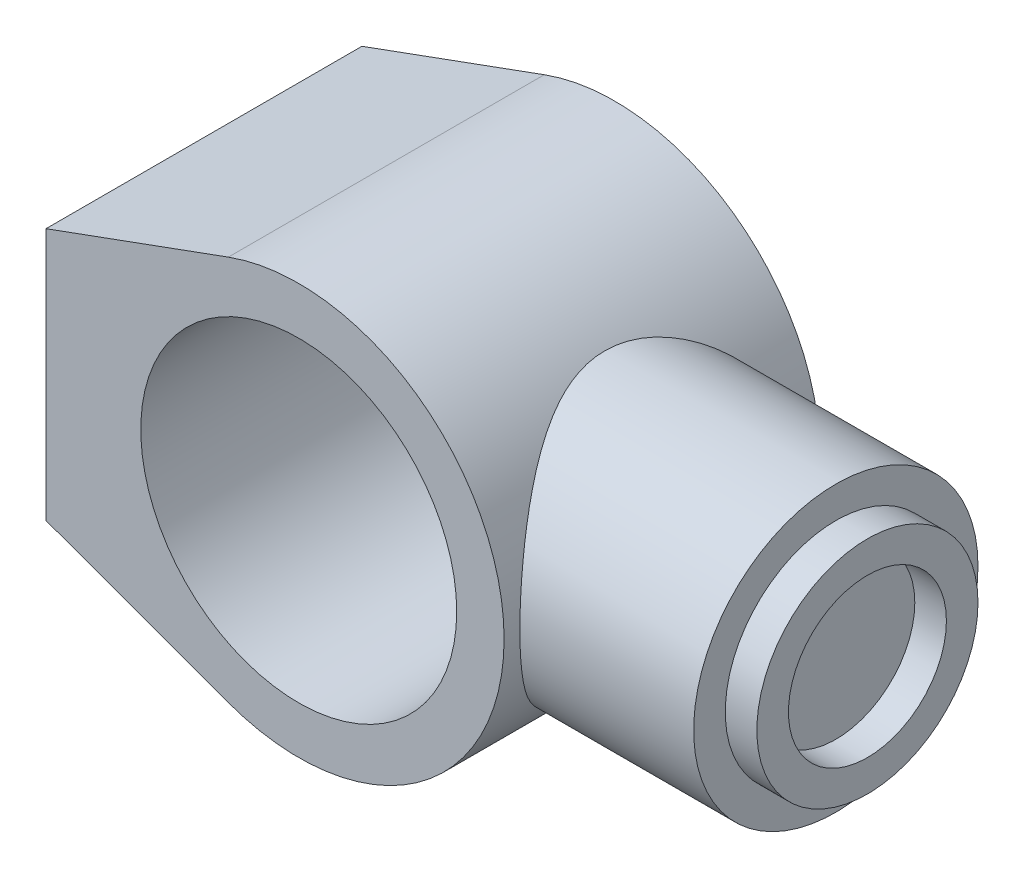
ISO-10303-21;
HEADER;
FILE_DESCRIPTION(('STEP AP214'),'2;1');
FILE_NAME('part.step','',(''),(''),'','','');
FILE_SCHEMA(('AUTOMOTIVE_DESIGN { 1 0 10303 214 1 1 1 1 }'));
ENDSEC;
DATA;
#1=APPLICATION_CONTEXT('core data for automotive mechanical design processes');
#2=APPLICATION_PROTOCOL_DEFINITION('international standard','automotive_design',2000,#1);
#3=PRODUCT_CONTEXT('',#1,'mechanical');
#4=PRODUCT('Part','Part','',(#3));
#5=PRODUCT_RELATED_PRODUCT_CATEGORY('part','',(#4));
#6=PRODUCT_DEFINITION_FORMATION('','',#4);
#7=PRODUCT_DEFINITION_CONTEXT('part definition',#1,'design');
#8=PRODUCT_DEFINITION('design','',#6,#7);
#9=PRODUCT_DEFINITION_SHAPE('','',#8);
#10=(LENGTH_UNIT() NAMED_UNIT(*) SI_UNIT(.MILLI.,.METRE.));
#11=(NAMED_UNIT(*) PLANE_ANGLE_UNIT() SI_UNIT($,.RADIAN.));
#12=(NAMED_UNIT(*) SI_UNIT($,.STERADIAN.) SOLID_ANGLE_UNIT());
#13=UNCERTAINTY_MEASURE_WITH_UNIT(LENGTH_MEASURE(1.E-05),#10,'distance_accuracy_value','');
#14=(GEOMETRIC_REPRESENTATION_CONTEXT(3) GLOBAL_UNCERTAINTY_ASSIGNED_CONTEXT((#13)) GLOBAL_UNIT_ASSIGNED_CONTEXT((#10,
#11,#12)) REPRESENTATION_CONTEXT('',''));
#15=CARTESIAN_POINT('',(0.,0.,0.));
#16=DIRECTION('',(0.,0.,1.));
#17=DIRECTION('',(1.,0.,0.));
#18=AXIS2_PLACEMENT_3D('',#15,#16,#17);
#19=CARTESIAN_POINT('',(0.,0.,50.));
#20=DIRECTION('',(0.,0.,1.));
#21=DIRECTION('',(1.,0.,0.));
#22=AXIS2_PLACEMENT_3D('',#19,#20,#21);
#23=PLANE('',#22);
#24=CARTESIAN_POINT('',(0.,0.,50.));
#25=DIRECTION('',(0.,0.,1.));
#26=DIRECTION('',(1.,0.,0.));
#27=AXIS2_PLACEMENT_3D('',#24,#25,#26);
#28=CIRCLE('',#27,65.);
#29=CARTESIAN_POINT('',(-22.2816656929027,-61.0616686141946,50.));
#30=VERTEX_POINT('',#29);
#31=CARTESIAN_POINT('',(-22.2816656929027,61.0616686141946,50.));
#32=VERTEX_POINT('',#31);
#33=EDGE_CURVE('E93',#30,#32,#28,.T.);
#34=ORIENTED_EDGE('',*,*,#33,.T.);
#35=DIRECTION('',(-0.939410286372225,-0.342794856813887,0.));
#36=VECTOR('',#35,1.);
#37=CARTESIAN_POINT('',(-80.,40.,50.));
#38=LINE('',#37,#36);
#39=CARTESIAN_POINT('',(-80.,40.,50.));
#40=VERTEX_POINT('',#39);
#41=EDGE_CURVE('E88',#32,#40,#38,.T.);
#42=ORIENTED_EDGE('',*,*,#41,.T.);
#43=DIRECTION('',(0.,-1.,0.));
#44=VECTOR('',#43,1.);
#45=CARTESIAN_POINT('',(-80.,40.,50.));
#46=LINE('',#45,#44);
#47=CARTESIAN_POINT('',(-80.,-40.,50.));
#48=VERTEX_POINT('',#47);
#49=EDGE_CURVE('E91',#40,#48,#46,.T.);
#50=ORIENTED_EDGE('',*,*,#49,.T.);
#51=DIRECTION('',(0.939410286372225,-0.342794856813887,0.));
#52=VECTOR('',#51,1.);
#53=CARTESIAN_POINT('',(-80.,-40.,50.));
#54=LINE('',#53,#52);
#55=EDGE_CURVE('E57',#48,#30,#54,.T.);
#56=ORIENTED_EDGE('',*,*,#55,.T.);
#57=EDGE_LOOP('',(#34,#42,#50,#56));
#58=FACE_BOUND('',#57,.T.);
#59=CARTESIAN_POINT('',(0.,0.,50.));
#60=DIRECTION('',(0.,0.,1.));
#61=DIRECTION('',(1.,0.,0.));
#62=AXIS2_PLACEMENT_3D('',#59,#60,#61);
#63=CIRCLE('',#62,50.);
#64=CARTESIAN_POINT('',(50.,0.,50.));
#65=VERTEX_POINT('',#64);
#66=EDGE_CURVE('E115',#65,#65,#63,.T.);
#67=ORIENTED_EDGE('',*,*,#66,.F.);
#68=EDGE_LOOP('',(#67));
#69=FACE_BOUND('',#68,.T.);
#70=ADVANCED_FACE('F39',(#58,#69),#23,.T.);
#71=CARTESIAN_POINT('',(0.,0.,-50.));
#72=DIRECTION('',(0.,0.,1.));
#73=DIRECTION('',(1.,0.,0.));
#74=AXIS2_PLACEMENT_3D('',#71,#72,#73);
#75=PLANE('',#74);
#76=CARTESIAN_POINT('',(0.,0.,-50.));
#77=DIRECTION('',(0.,0.,1.));
#78=DIRECTION('',(1.,0.,0.));
#79=AXIS2_PLACEMENT_3D('',#76,#77,#78);
#80=CIRCLE('',#79,65.);
#81=CARTESIAN_POINT('',(-22.2816656929027,-61.0616686141946,-50.));
#82=VERTEX_POINT('',#81);
#83=CARTESIAN_POINT('',(-22.2816656929027,61.0616686141946,-50.));
#84=VERTEX_POINT('',#83);
#85=EDGE_CURVE('E111',#82,#84,#80,.T.);
#86=ORIENTED_EDGE('',*,*,#85,.F.);
#87=DIRECTION('',(0.939410286372225,-0.342794856813887,0.));
#88=VECTOR('',#87,1.);
#89=CARTESIAN_POINT('',(-80.,-40.,-50.));
#90=LINE('',#89,#88);
#91=CARTESIAN_POINT('',(-80.,-40.,-50.));
#92=VERTEX_POINT('',#91);
#93=EDGE_CURVE('E80',#92,#82,#90,.T.);
#94=ORIENTED_EDGE('',*,*,#93,.F.);
#95=DIRECTION('',(0.,-1.,0.));
#96=VECTOR('',#95,1.);
#97=CARTESIAN_POINT('',(-80.,40.,-50.));
#98=LINE('',#97,#96);
#99=CARTESIAN_POINT('',(-80.,40.,-50.));
#100=VERTEX_POINT('',#99);
#101=EDGE_CURVE('E74',#100,#92,#98,.T.);
#102=ORIENTED_EDGE('',*,*,#101,.F.);
#103=DIRECTION('',(-0.939410286372225,-0.342794856813887,0.));
#104=VECTOR('',#103,1.);
#105=CARTESIAN_POINT('',(-80.,40.,-50.));
#106=LINE('',#105,#104);
#107=EDGE_CURVE('E99',#84,#100,#106,.T.);
#108=ORIENTED_EDGE('',*,*,#107,.F.);
#109=EDGE_LOOP('',(#86,#94,#102,#108));
#110=FACE_BOUND('',#109,.T.);
#111=CARTESIAN_POINT('',(0.,0.,-50.));
#112=DIRECTION('',(0.,0.,1.));
#113=DIRECTION('',(1.,0.,0.));
#114=AXIS2_PLACEMENT_3D('',#111,#112,#113);
#115=CIRCLE('',#114,50.);
#116=CARTESIAN_POINT('',(50.,0.,-50.));
#117=VERTEX_POINT('',#116);
#118=EDGE_CURVE('E135',#117,#117,#115,.T.);
#119=ORIENTED_EDGE('',*,*,#118,.T.);
#120=EDGE_LOOP('',(#119));
#121=FACE_BOUND('',#120,.T.);
#122=ADVANCED_FACE('F129',(#110,#121),#75,.F.);
#123=CARTESIAN_POINT('',(0.,0.,50.));
#124=DIRECTION('',(0.,0.,-1.));
#125=DIRECTION('',(-1.,0.,0.));
#126=AXIS2_PLACEMENT_3D('',#123,#124,#125);
#127=CYLINDRICAL_SURFACE('',#126,65.);
#128=CARTESIAN_POINT('',(65.,0.,-45.));
#129=CARTESIAN_POINT('',(65.0000011696057,1.12147330120565,-45.0000012025283));
#130=CARTESIAN_POINT('',(64.9709159765212,2.24292945230778,-44.9580201602482));
#131=CARTESIAN_POINT('',(64.8553068641383,4.47658414079082,-44.790785609369));
#132=CARTESIAN_POINT('',(64.7687842573088,5.58878288911931,-44.6655340035371));
#133=CARTESIAN_POINT('',(64.5403785763001,7.79555151848628,-44.3336771879691));
#134=CARTESIAN_POINT('',(64.3984760503456,8.89011506447751,-44.1270433931238));
#135=CARTESIAN_POINT('',(64.0626457436966,11.0533096019768,-43.6354760134034));
#136=CARTESIAN_POINT('',(63.8687169569864,12.1219400915896,-43.3505409144375));
#137=CARTESIAN_POINT('',(63.4342222744662,14.2212125160505,-42.7078017297046));
#138=CARTESIAN_POINT('',(63.1938918545645,15.2520162370063,-42.3503651251477));
#139=CARTESIAN_POINT('',(62.6709259446924,17.2756280115286,-41.5659763086892));
#140=CARTESIAN_POINT('',(62.3882907364915,18.268436318107,-41.1390245597888));
#141=CARTESIAN_POINT('',(61.786108553932,20.2116697228795,-40.2199419970838));
#142=CARTESIAN_POINT('',(61.4665619062631,21.1620951960855,-39.7278117601444));
#143=CARTESIAN_POINT('',(60.7962171584065,23.0172309124314,-38.6825647509799));
#144=CARTESIAN_POINT('',(60.4454175300334,23.9219389167185,-38.1294449962195));
#145=CARTESIAN_POINT('',(59.6865648974474,25.7601880140228,-36.9151737617935));
#146=CARTESIAN_POINT('',(59.27618815402,26.6893215363404,-36.2488040005491));
#147=CARTESIAN_POINT('',(58.4330275057249,28.4880338622967,-34.8529502059224));
#148=CARTESIAN_POINT('',(58.0002425478181,29.3576098626539,-34.1234632053608));
#149=CARTESIAN_POINT('',(57.1195111836477,31.0364486388513,-32.6040251352403));
#150=CARTESIAN_POINT('',(56.6715447181891,31.8456267033451,-31.8139921794123));
#151=CARTESIAN_POINT('',(55.7691986061138,33.4006700551814,-30.1773036556993));
#152=CARTESIAN_POINT('',(55.3148185876119,34.1465316534289,-29.3306447936721));
#153=CARTESIAN_POINT('',(54.3303114345595,35.6959084068904,-27.4326466159468));
#154=CARTESIAN_POINT('',(53.8005937511269,36.4872853280241,-26.3711450656527));
#155=CARTESIAN_POINT('',(52.7593327891933,37.9773509509911,-24.17604025639));
#156=CARTESIAN_POINT('',(52.2477941160227,38.6760162868262,-23.0424189272517));
#157=CARTESIAN_POINT('',(51.2608149265043,39.9749077721744,-20.7072341856928));
#158=CARTESIAN_POINT('',(50.7853275075273,40.5752630453964,-19.5057627267967));
#159=CARTESIAN_POINT('',(49.8892399163793,41.6721166930025,-17.036931864064));
#160=CARTESIAN_POINT('',(49.4686114171658,42.1686687478853,-15.7696069409943));
#161=CARTESIAN_POINT('',(48.8208029416879,42.9149535309565,-13.5723996352816));
#162=CARTESIAN_POINT('',(48.5738420263557,43.1936925213245,-12.6581208440976));
#163=CARTESIAN_POINT('',(48.1238801744123,43.6944569649788,-10.8035389223551));
#164=CARTESIAN_POINT('',(47.9208721021929,43.9164916250901,-9.86324004407419));
#165=CARTESIAN_POINT('',(47.5660754926548,44.3005296261305,-7.96250438663409));
#166=CARTESIAN_POINT('',(47.4142038087044,44.4626304606427,-7.00210302149487));
#167=CARTESIAN_POINT('',(47.1671263845177,44.7246555122386,-5.06554052628518));
#168=CARTESIAN_POINT('',(47.0719206259529,44.824579749433,-4.08937940131224));
#169=CARTESIAN_POINT('',(46.9418899090943,44.9607388198673,-2.1232364847967));
#170=CARTESIAN_POINT('',(46.9073939345417,44.9966266570423,-1.13320851844658));
#171=CARTESIAN_POINT('',(46.9013571135476,45.0029190462422,0.847248377093852));
#172=CARTESIAN_POINT('',(46.9298161498631,44.9733237202183,1.837677305534));
#173=CARTESIAN_POINT('',(47.0484302849821,44.8492190899201,3.81128752429081));
#174=CARTESIAN_POINT('',(47.13862305521,44.7546701492421,4.79446401850661));
#175=CARTESIAN_POINT('',(47.3768313176079,44.5024241630868,6.74551496467455));
#176=CARTESIAN_POINT('',(47.5248480621437,44.3447257499009,7.71338908473168));
#177=CARTESIAN_POINT('',(47.8621764271841,43.9803320764262,9.56919366964684));
#178=CARTESIAN_POINT('',(48.0484149088864,43.7772163066585,10.4583970625519));
#179=CARTESIAN_POINT('',(48.4609441046406,43.32010640119,12.2144143492181));
#180=CARTESIAN_POINT('',(48.6872496045115,43.0660934784815,13.0812198417583));
#181=CARTESIAN_POINT('',(49.1738509640383,42.5096331932465,14.7898225666927));
#182=CARTESIAN_POINT('',(49.4341648638834,42.2071601049958,15.6316062329481));
#183=CARTESIAN_POINT('',(49.9825182796335,41.5563350032134,17.2876417419013));
#184=CARTESIAN_POINT('',(50.2705534011697,41.2079902580444,18.1018979206949));
#185=CARTESIAN_POINT('',(51.0225431471345,40.2767822129268,20.1137766396802));
#186=CARTESIAN_POINT('',(51.5007434523328,39.6654891440572,21.2930273345177));
#187=CARTESIAN_POINT('',(52.4891158781477,38.348029920852,23.5833678403921));
#188=CARTESIAN_POINT('',(52.9993005340589,37.6418264436726,24.6944305853524));
#189=CARTESIAN_POINT('',(54.0361557973494,36.1376496350166,26.8476775780095));
#190=CARTESIAN_POINT('',(54.5628535785461,35.3395185623559,27.8897384505711));
#191=CARTESIAN_POINT('',(55.6171804467178,33.6558443419671,29.8998791095632));
#192=CARTESIAN_POINT('',(56.1448094104418,32.7703120184234,30.8679680307498));
#193=CARTESIAN_POINT('',(57.1932449701135,30.9045304086319,32.7363921475659));
#194=CARTESIAN_POINT('',(57.7139191350983,29.9233731295192,33.6358963165067));
#195=CARTESIAN_POINT('',(58.7296419536465,27.8771206485979,35.350355349792));
#196=CARTESIAN_POINT('',(59.2246882700661,26.8120178135979,36.1653025097018));
#197=CARTESIAN_POINT('',(60.1756566955639,24.6035209522421,37.7024332048813));
#198=CARTESIAN_POINT('',(60.6316475651595,23.4602711709794,38.4247809320632));
#199=CARTESIAN_POINT('',(61.4931891608211,21.0989507187335,39.7703323765769));
#200=CARTESIAN_POINT('',(61.898755017873,19.8809026570889,40.3935658507715));
#201=CARTESIAN_POINT('',(62.5646802947783,17.6549035875762,41.4059204565395));
#202=CARTESIAN_POINT('',(62.8372982548467,16.6602403417733,41.8163120535009));
#203=CARTESIAN_POINT('',(63.3397164077328,14.6345031625144,42.5675669112335));
#204=CARTESIAN_POINT('',(63.569522535998,13.603434299959,42.9084398107234));
#205=CARTESIAN_POINT('',(63.9815049902596,11.5110112910016,43.5164676119118));
#206=CARTESIAN_POINT('',(64.1637052650743,10.4496726714621,43.7836595836378));
#207=CARTESIAN_POINT('',(64.476639865795,8.30296993183371,44.2409869387356));
#208=CARTESIAN_POINT('',(64.6073730982257,7.21760530180254,44.431120684921));
#209=CARTESIAN_POINT('',(64.8147345736682,5.02649787175023,44.7321113931983));
#210=CARTESIAN_POINT('',(64.8911534961694,3.92069290489763,44.8426616714377));
#211=CARTESIAN_POINT('',(64.9872183357685,1.70145350776208,44.981563734156));
#212=CARTESIAN_POINT('',(65.0068642771874,0.588019080747696,45.0099155538474));
#213=CARTESIAN_POINT('',(64.9889001241945,-1.63741781931566,44.9839662509349));
#214=CARTESIAN_POINT('',(64.9512898349751,-2.74942028747967,44.929664847113));
#215=CARTESIAN_POINT('',(64.819734418053,-4.96298947367603,44.7392747901952));
#216=CARTESIAN_POINT('',(64.7257910494465,-6.06455651648127,44.6031886909653));
#217=CARTESIAN_POINT('',(64.491175703309,-8.18254449212149,44.2620157992034));
#218=CARTESIAN_POINT('',(64.3536808680178,-9.20007959997774,44.0616107864454));
#219=CARTESIAN_POINT('',(64.0337856060908,-11.2121337136589,43.5930613516679));
#220=CARTESIAN_POINT('',(63.8513873855499,-12.2066538475799,43.3249202574929));
#221=CARTESIAN_POINT('',(63.4451725249075,-14.1673074608523,42.7239854011605));
#222=CARTESIAN_POINT('',(63.2213525684632,-15.1334386601223,42.3911864622047));
#223=CARTESIAN_POINT('',(62.736336352677,-17.0327019487273,41.6643868113868));
#224=CARTESIAN_POINT('',(62.4751380044848,-17.965832190203,41.2703826790343));
#225=CARTESIAN_POINT('',(61.8990085085122,-19.8637431772395,40.3931275129008));
#226=CARTESIAN_POINT('',(61.5815209528501,-20.8256806929253,39.9054081529014));
#227=CARTESIAN_POINT('',(60.9142086391395,-22.7035764997345,38.8677076181211));
#228=CARTESIAN_POINT('',(60.5643826081083,-23.6195329786528,38.3177239921568));
#229=CARTESIAN_POINT('',(59.8381347129401,-25.4032558353403,37.1592008079418));
#230=CARTESIAN_POINT('',(59.4616987975441,-26.270996314329,36.5506302507532));
#231=CARTESIAN_POINT('',(58.6884577670336,-27.9557544991496,35.2787474176625));
#232=CARTESIAN_POINT('',(58.2916515549571,-28.7727694681138,34.6154321925309));
#233=CARTESIAN_POINT('',(57.4151711853793,-30.4889708749912,33.1199200847161));
#234=CARTESIAN_POINT('',(56.9328754552547,-31.3785212006928,32.2781812569548));
#235=CARTESIAN_POINT('',(55.9590893109094,-33.0839042215169,30.5278352445589));
#236=CARTESIAN_POINT('',(55.4675975421249,-33.8997259516808,29.6192181500899));
#237=CARTESIAN_POINT('',(54.4860350387397,-35.45586994741,27.7375714933993));
#238=CARTESIAN_POINT('',(53.9959654596117,-36.1961418986443,26.7644997080007));
#239=CARTESIAN_POINT('',(53.0294834997435,-37.5978502361011,24.7568233036382));
#240=CARTESIAN_POINT('',(52.553069328415,-38.2592969946585,23.7222268074148));
#241=CARTESIAN_POINT('',(51.679941347726,-39.4291013564639,21.7149007388747));
#242=CARTESIAN_POINT('',(51.2803372484816,-39.9463152685162,20.7485884228094));
#243=CARTESIAN_POINT('',(50.5123974548912,-40.9130636661729,18.7705314851885));
#244=CARTESIAN_POINT('',(50.1440619804653,-41.3625976757848,17.7587865441704));
#245=CARTESIAN_POINT('',(49.4504928922364,-42.1893301292689,15.693797265063));
#246=CARTESIAN_POINT('',(49.1251906412473,-42.566644202947,14.6406225749502));
#247=CARTESIAN_POINT('',(48.5290098021012,-43.2451098617227,12.4950157035289));
#248=CARTESIAN_POINT('',(48.2581179989952,-43.5462799449171,11.4025931307277));
#249=CARTESIAN_POINT('',(47.8271610412375,-44.0186874861181,9.3921629994351));
#250=CARTESIAN_POINT('',(47.6558419905218,-44.2036946073207,8.47979353570419));
#251=CARTESIAN_POINT('',(47.3627606953031,-44.517583244497,6.63757582668245));
#252=CARTESIAN_POINT('',(47.2409923142224,-44.6464717105955,5.70772976070373));
#253=CARTESIAN_POINT('',(47.05166615705,-44.8459556683364,3.83718735816971));
#254=CARTESIAN_POINT('',(46.9840561376509,-44.9166073394187,2.89650236820514));
#255=CARTESIAN_POINT('',(46.9055698265682,-44.9985645522097,1.01014116515035));
#256=CARTESIAN_POINT('',(46.894694331428,-45.0098692606967,0.0644648821697862));
#257=CARTESIAN_POINT('',(46.9301408777119,-44.972908524549,-1.82506201386804));
#258=CARTESIAN_POINT('',(46.9764888551696,-44.9246160680299,-2.76891160474201));
#259=CARTESIAN_POINT('',(47.1245232303033,-44.7693052695385,-4.64731891289862));
#260=CARTESIAN_POINT('',(47.226209296244,-44.6622872796082,-5.58187668584874));
#261=CARTESIAN_POINT('',(47.4811423262629,-44.3911660407895,-7.43666598606561));
#262=CARTESIAN_POINT('',(47.634452919394,-44.2269923369625,-8.35687836049678));
#263=CARTESIAN_POINT('',(47.9871889035597,-43.8440109221367,-10.1768310643423));
#264=CARTESIAN_POINT('',(48.1866204648689,-43.6251959006593,-11.0765686368372));
#265=CARTESIAN_POINT('',(48.6908782922366,-43.0625185245671,-13.116726178063));
#266=CARTESIAN_POINT('',(49.0093972350599,-42.7008255731353,-14.2488681052183));
#267=CARTESIAN_POINT('',(49.699554494161,-41.8955268796886,-16.4668795226373));
#268=CARTESIAN_POINT('',(50.0712093704162,-41.4518955887103,-17.5527344499461));
#269=CARTESIAN_POINT('',(50.8544123719762,-40.4872212981013,-19.6760329984318));
#270=CARTESIAN_POINT('',(51.2660067549033,-39.9660881554129,-20.7134183727638));
#271=CARTESIAN_POINT('',(52.116211879306,-38.8508952329155,-22.7363587217865));
#272=CARTESIAN_POINT('',(52.5548209260535,-38.2568400254561,-23.7219169406072));
#273=CARTESIAN_POINT('',(53.4579357785502,-36.9847423381263,-25.6613286822633));
#274=CARTESIAN_POINT('',(53.9228021101371,-36.3051118639051,-26.6139712103077));
#275=CARTESIAN_POINT('',(54.8583333343946,-34.8753950985048,-28.4617532840731));
#276=CARTESIAN_POINT('',(55.3289982185488,-34.1253089107936,-29.3568929142368));
#277=CARTESIAN_POINT('',(56.2664339133503,-32.5564691651912,-31.0876310121466));
#278=CARTESIAN_POINT('',(56.7332035093429,-31.7376950080829,-31.923211478402));
#279=CARTESIAN_POINT('',(57.6535165855435,-30.033481652025,-33.5315189390535));
#280=CARTESIAN_POINT('',(58.1070588196762,-29.1480362003111,-34.3042400240121));
#281=CARTESIAN_POINT('',(59.0635284336244,-27.1643113596245,-35.9022819462667));
#282=CARTESIAN_POINT('',(59.5626106290919,-26.0547472869609,-36.7159606163356));
#283=CARTESIAN_POINT('',(60.5176757229357,-23.7521280348398,-38.2458641369291));
#284=CARTESIAN_POINT('',(60.9736519283074,-22.5590599397198,-38.962073861155));
#285=CARTESIAN_POINT('',(61.6149926579414,-20.7127348127311,-39.9558623322098));
#286=CARTESIAN_POINT('',(61.8215919655179,-20.088110583999,-40.2735888165198));
#287=CARTESIAN_POINT('',(62.2191547005856,-18.8206694867556,-40.8812436548858));
#288=CARTESIAN_POINT('',(62.4101203779565,-18.1778552539997,-41.1711760099034));
#289=CARTESIAN_POINT('',(62.7748527233683,-16.875283117665,-41.7219931318356));
#290=CARTESIAN_POINT('',(62.9486230408552,-16.2155288469421,-41.9828840638124));
#291=CARTESIAN_POINT('',(63.2775356475737,-14.8804011558233,-42.4744610119283));
#292=CARTESIAN_POINT('',(63.432679284421,-14.2050288695917,-42.7051492133046));
#293=CARTESIAN_POINT('',(63.8070721968101,-12.4447010544915,-43.25974494481));
#294=CARTESIAN_POINT('',(64.0114184468014,-11.3490405228654,-43.5602757498286));
#295=CARTESIAN_POINT('',(64.3654191982087,-9.12991345978806,-44.078827644396));
#296=CARTESIAN_POINT('',(64.5150820049425,-8.00645117856259,-44.2968612637911));
#297=CARTESIAN_POINT('',(64.7559993187061,-5.74082253729113,-44.6470112993716));
#298=CARTESIAN_POINT('',(64.847297757104,-4.59867091062173,-44.7791923387443));
#299=CARTESIAN_POINT('',(64.9692976296881,-2.30434018473195,-44.9556862638234));
#300=CARTESIAN_POINT('',(64.9999987983895,-1.15216104160189,-44.999998764566));
#301=CARTESIAN_POINT('',(65.,0.,-45.));
#302=B_SPLINE_CURVE_WITH_KNOTS('',3,(#128,#129,#130,#131,#132,#133,#134,#135,#136,#137,#138,
#139,#140,#141,#142,#143,#144,#145,#146,#147,#148,#149,#150,#151,#152,#153,#154,#155,#156,#157,
#158,#159,#160,#161,#162,#163,#164,#165,#166,#167,#168,#169,#170,#171,#172,#173,#174,#175,#176,
#177,#178,#179,#180,#181,#182,#183,#184,#185,#186,#187,#188,#189,#190,#191,#192,#193,#194,#195,
#196,#197,#198,#199,#200,#201,#202,#203,#204,#205,#206,#207,#208,#209,#210,#211,#212,#213,#214,
#215,#216,#217,#218,#219,#220,#221,#222,#223,#224,#225,#226,#227,#228,#229,#230,#231,#232,#233,
#234,#235,#236,#237,#238,#239,#240,#241,#242,#243,#244,#245,#246,#247,#248,#249,#250,#251,#252,
#253,#254,#255,#256,#257,#258,#259,#260,#261,#262,#263,#264,#265,#266,#267,#268,#269,#270,#271,
#272,#273,#274,#275,#276,#277,#278,#279,#280,#281,#282,#283,#284,#285,#286,#287,#288,#289,#290,
#291,#292,#293,#294,#295,#296,#297,#298,#299,#300,#301),.UNSPECIFIED.,.T.,.F.,(4,2,2,2,2,2,2,2,
2,2,2,2,2,2,2,2,2,2,2,2,2,2,2,2,2,2,2,2,2,2,2,2,2,2,2,2,2,2,2,2,2,2,2,2,2,2,2,2,2,2,2,2,2,2,2,2,
2,2,2,2,2,2,2,2,2,2,2,2,2,2,2,2,2,2,2,2,2,2,2,2,2,2,2,2,2,2,4),(0.,3.36323892794144,
6.72640100710137,10.0907454360665,13.4551549250109,16.8029195613731,20.1506619010729,
23.4983746134034,26.8462511096753,30.4871649037346,34.1282499524345,37.7743494260164,
41.4206611917409,45.6939383064405,49.9682903731881,54.2369825353392,58.5034617073671,
61.4625138492405,64.4210852373372,67.3748225577202,70.3285589227263,73.2982527376573,
76.2679410220407,79.2394430998938,82.2110095388412,85.0011411726389,87.7923045951578,
90.584954683776,93.3771628083065,97.6064034875675,101.837312178738,106.075592113262,
110.313347816192,114.596218662803,118.879479402292,123.155037051935,127.429308626693,
130.755998382163,134.082226580387,137.406778235214,140.731400520075,144.068767009318,
147.406132068879,150.743508483461,154.080780688207,157.215791533369,160.350648386749,
163.485756334407,166.621039552604,169.990545063149,173.360183268584,176.73161428665,
180.103227050672,184.047902440152,187.993163521895,191.94103513809,195.888386692538,
199.385185586645,202.88200907258,206.373186157811,209.863514294626,212.700365177753,
215.536864625513,218.370624567028,221.204424293963,224.039508887241,226.874576485218,
229.713151272815,232.55210603787,236.23803941247,239.925124033801,243.616531168718,
247.307706963636,251.081871120678,254.856029735252,258.631324277359,262.406973327354,
266.792058434818,271.177823293658,273.368885604935,275.55963203795,277.749912517597,
279.940034437727,283.398420446896,286.856280978073,290.31153567335,293.766805506531),.UNSPECIFIED.);
#303=CARTESIAN_POINT('',(65.,0.,-45.));
#304=VERTEX_POINT('',#303);
#305=EDGE_CURVE('E145',#304,#304,#302,.T.);
#306=ORIENTED_EDGE('',*,*,#305,.F.);
#307=EDGE_LOOP('',(#306));
#308=FACE_BOUND('',#307,.T.);
#309=ORIENTED_EDGE('',*,*,#85,.T.);
#310=DIRECTION('',(0.,0.,-1.));
#311=VECTOR('',#310,1.);
#312=CARTESIAN_POINT('',(-22.2816656929027,61.0616686141946,50.));
#313=LINE('',#312,#311);
#314=EDGE_CURVE('E49',#32,#84,#313,.T.);
#315=ORIENTED_EDGE('',*,*,#314,.F.);
#316=ORIENTED_EDGE('',*,*,#33,.F.);
#317=DIRECTION('',(0.,0.,-1.));
#318=VECTOR('',#317,1.);
#319=CARTESIAN_POINT('',(-22.2816656929027,-61.0616686141946,50.));
#320=LINE('',#319,#318);
#321=EDGE_CURVE('E107',#30,#82,#320,.T.);
#322=ORIENTED_EDGE('',*,*,#321,.T.);
#323=EDGE_LOOP('',(#309,#315,#316,#322));
#324=FACE_BOUND('',#323,.T.);
#325=ADVANCED_FACE('F41',(#308,#324),#127,.T.);
#326=CARTESIAN_POINT('',(-80.,40.,50.));
#327=DIRECTION('',(0.342794856813887,-0.939410286372225,0.));
#328=DIRECTION('',(0.939410286372225,0.342794856813887,0.));
#329=AXIS2_PLACEMENT_3D('',#326,#327,#328);
#330=PLANE('',#329);
#331=ORIENTED_EDGE('',*,*,#107,.T.);
#332=DIRECTION('',(0.,0.,-1.));
#333=VECTOR('',#332,1.);
#334=CARTESIAN_POINT('',(-80.,40.,50.));
#335=LINE('',#334,#333);
#336=EDGE_CURVE('E97',#40,#100,#335,.T.);
#337=ORIENTED_EDGE('',*,*,#336,.F.);
#338=ORIENTED_EDGE('',*,*,#41,.F.);
#339=ORIENTED_EDGE('',*,*,#314,.T.);
#340=EDGE_LOOP('',(#331,#337,#338,#339));
#341=FACE_BOUND('',#340,.T.);
#342=ADVANCED_FACE('F98',(#341),#330,.F.);
#343=CARTESIAN_POINT('',(-80.,40.,50.));
#344=DIRECTION('',(1.,0.,0.));
#345=DIRECTION('',(0.,0.,-1.));
#346=AXIS2_PLACEMENT_3D('',#343,#344,#345);
#347=PLANE('',#346);
#348=ORIENTED_EDGE('',*,*,#101,.T.);
#349=DIRECTION('',(0.,0.,-1.));
#350=VECTOR('',#349,1.);
#351=CARTESIAN_POINT('',(-80.,-40.,50.));
#352=LINE('',#351,#350);
#353=EDGE_CURVE('E101',#48,#92,#352,.T.);
#354=ORIENTED_EDGE('',*,*,#353,.F.);
#355=ORIENTED_EDGE('',*,*,#49,.F.);
#356=ORIENTED_EDGE('',*,*,#336,.T.);
#357=EDGE_LOOP('',(#348,#354,#355,#356));
#358=FACE_BOUND('',#357,.T.);
#359=ADVANCED_FACE('F103',(#358),#347,.F.);
#360=CARTESIAN_POINT('',(-80.,-40.,50.));
#361=DIRECTION('',(0.342794856813887,0.939410286372225,0.));
#362=DIRECTION('',(-0.939410286372225,0.342794856813887,0.));
#363=AXIS2_PLACEMENT_3D('',#360,#361,#362);
#364=PLANE('',#363);
#365=ORIENTED_EDGE('',*,*,#93,.T.);
#366=ORIENTED_EDGE('',*,*,#321,.F.);
#367=ORIENTED_EDGE('',*,*,#55,.F.);
#368=ORIENTED_EDGE('',*,*,#353,.T.);
#369=EDGE_LOOP('',(#365,#366,#367,#368));
#370=FACE_BOUND('',#369,.T.);
#371=ADVANCED_FACE('F191',(#370),#364,.F.);
#372=CARTESIAN_POINT('',(0.,0.,50.));
#373=DIRECTION('',(0.,0.,-1.));
#374=DIRECTION('',(-1.,0.,0.));
#375=AXIS2_PLACEMENT_3D('',#372,#373,#374);
#376=CYLINDRICAL_SURFACE('',#375,50.);
#377=ORIENTED_EDGE('',*,*,#66,.T.);
#378=EDGE_LOOP('',(#377));
#379=FACE_BOUND('',#378,.T.);
#380=ORIENTED_EDGE('',*,*,#118,.F.);
#381=EDGE_LOOP('',(#380));
#382=FACE_BOUND('',#381,.T.);
#383=ADVANCED_FACE('F166',(#379,#382),#376,.F.);
#384=CARTESIAN_POINT('',(120.,0.,0.));
#385=DIRECTION('',(1.,0.,0.));
#386=DIRECTION('',(0.,0.,-1.));
#387=AXIS2_PLACEMENT_3D('',#384,#385,#386);
#388=PLANE('',#387);
#389=CARTESIAN_POINT('',(120.,0.,0.));
#390=DIRECTION('',(1.,0.,0.));
#391=DIRECTION('',(0.,0.,-1.));
#392=AXIS2_PLACEMENT_3D('',#389,#390,#391);
#393=CIRCLE('',#392,35.);
#394=CARTESIAN_POINT('',(120.,0.,-35.));
#395=VERTEX_POINT('',#394);
#396=EDGE_CURVE('E286',#395,#395,#393,.T.);
#397=ORIENTED_EDGE('',*,*,#396,.F.);
#398=EDGE_LOOP('',(#397));
#399=FACE_BOUND('',#398,.T.);
#400=CARTESIAN_POINT('',(120.,0.,0.));
#401=DIRECTION('',(1.,0.,0.));
#402=DIRECTION('',(0.,0.,-1.));
#403=AXIS2_PLACEMENT_3D('',#400,#401,#402);
#404=CIRCLE('',#403,45.);
#405=CARTESIAN_POINT('',(120.,0.,-45.));
#406=VERTEX_POINT('',#405);
#407=EDGE_CURVE('E138',#406,#406,#404,.T.);
#408=ORIENTED_EDGE('',*,*,#407,.T.);
#409=EDGE_LOOP('',(#408));
#410=FACE_BOUND('',#409,.T.);
#411=ADVANCED_FACE('F163',(#399,#410),#388,.T.);
#412=CARTESIAN_POINT('',(-80.002,0.,0.));
#413=DIRECTION('',(1.,0.,0.));
#414=DIRECTION('',(0.,0.,-1.));
#415=AXIS2_PLACEMENT_3D('',#412,#413,#414);
#416=CYLINDRICAL_SURFACE('',#415,45.);
#417=ORIENTED_EDGE('',*,*,#407,.F.);
#418=EDGE_LOOP('',(#417));
#419=FACE_BOUND('',#418,.T.);
#420=ORIENTED_EDGE('',*,*,#305,.T.);
#421=EDGE_LOOP('',(#420));
#422=FACE_BOUND('',#421,.T.);
#423=ADVANCED_FACE('F158',(#419,#422),#416,.T.);
#424=CARTESIAN_POINT('',(130.,0.,0.));
#425=DIRECTION('',(1.,0.,0.));
#426=DIRECTION('',(0.,0.,-1.));
#427=AXIS2_PLACEMENT_3D('',#424,#425,#426);
#428=PLANE('',#427);
#429=CARTESIAN_POINT('',(130.,0.,0.));
#430=DIRECTION('',(1.,0.,0.));
#431=DIRECTION('',(0.,0.,-1.));
#432=AXIS2_PLACEMENT_3D('',#429,#430,#431);
#433=CIRCLE('',#432,35.);
#434=CARTESIAN_POINT('',(130.,0.,-35.));
#435=VERTEX_POINT('',#434);
#436=EDGE_CURVE('E156',#435,#435,#433,.T.);
#437=ORIENTED_EDGE('',*,*,#436,.T.);
#438=EDGE_LOOP('',(#437));
#439=FACE_BOUND('',#438,.T.);
#440=CARTESIAN_POINT('',(130.,0.,0.));
#441=DIRECTION('',(1.,0.,0.));
#442=DIRECTION('',(0.,0.,-1.));
#443=AXIS2_PLACEMENT_3D('',#440,#441,#442);
#444=CIRCLE('',#443,25.);
#445=CARTESIAN_POINT('',(130.,0.,-25.));
#446=VERTEX_POINT('',#445);
#447=EDGE_CURVE('E282',#446,#446,#444,.T.);
#448=ORIENTED_EDGE('',*,*,#447,.F.);
#449=EDGE_LOOP('',(#448));
#450=FACE_BOUND('',#449,.T.);
#451=ADVANCED_FACE('F173',(#439,#450),#428,.T.);
#452=CARTESIAN_POINT('',(130.,0.,0.));
#453=DIRECTION('',(-1.,0.,0.));
#454=DIRECTION('',(0.,0.,1.));
#455=AXIS2_PLACEMENT_3D('',#452,#453,#454);
#456=CYLINDRICAL_SURFACE('',#455,35.);
#457=ORIENTED_EDGE('',*,*,#436,.F.);
#458=EDGE_LOOP('',(#457));
#459=FACE_BOUND('',#458,.T.);
#460=ORIENTED_EDGE('',*,*,#396,.T.);
#461=EDGE_LOOP('',(#460));
#462=FACE_BOUND('',#461,.T.);
#463=ADVANCED_FACE('F169',(#459,#462),#456,.T.);
#464=CARTESIAN_POINT('',(130.,0.,0.));
#465=DIRECTION('',(-1.,0.,0.));
#466=DIRECTION('',(0.,0.,1.));
#467=AXIS2_PLACEMENT_3D('',#464,#465,#466);
#468=CYLINDRICAL_SURFACE('',#467,25.);
#469=ORIENTED_EDGE('',*,*,#447,.T.);
#470=EDGE_LOOP('',(#469));
#471=FACE_BOUND('',#470,.T.);
#472=CARTESIAN_POINT('',(120.,0.,0.));
#473=DIRECTION('',(1.,0.,0.));
#474=DIRECTION('',(0.,0.,-1.));
#475=AXIS2_PLACEMENT_3D('',#472,#473,#474);
#476=CIRCLE('',#475,25.);
#477=CARTESIAN_POINT('',(120.,0.,-25.));
#478=VERTEX_POINT('',#477);
#479=EDGE_CURVE('E11',#478,#478,#476,.F.);
#480=ORIENTED_EDGE('',*,*,#479,.T.);
#481=EDGE_LOOP('',(#480));
#482=FACE_BOUND('',#481,.T.);
#483=ADVANCED_FACE('F172',(#471,#482),#468,.F.);
#484=ORIENTED_EDGE('',*,*,#479,.F.);
#485=EDGE_LOOP('',(#484));
#486=FACE_BOUND('',#485,.T.);
#487=ADVANCED_FACE('F168',(#486),#388,.T.);
#488=CLOSED_SHELL('',(#70,#122,#325,#342,#359,#371,#383,#411,#423,#451,#463,#483,#487));
#489=MANIFOLD_SOLID_BREP('B2',#488);
#490=ADVANCED_BREP_SHAPE_REPRESENTATION('',(#18,#489),#14);
#491=SHAPE_DEFINITION_REPRESENTATION(#9,#490);
ENDSEC;
END-ISO-10303-21;
